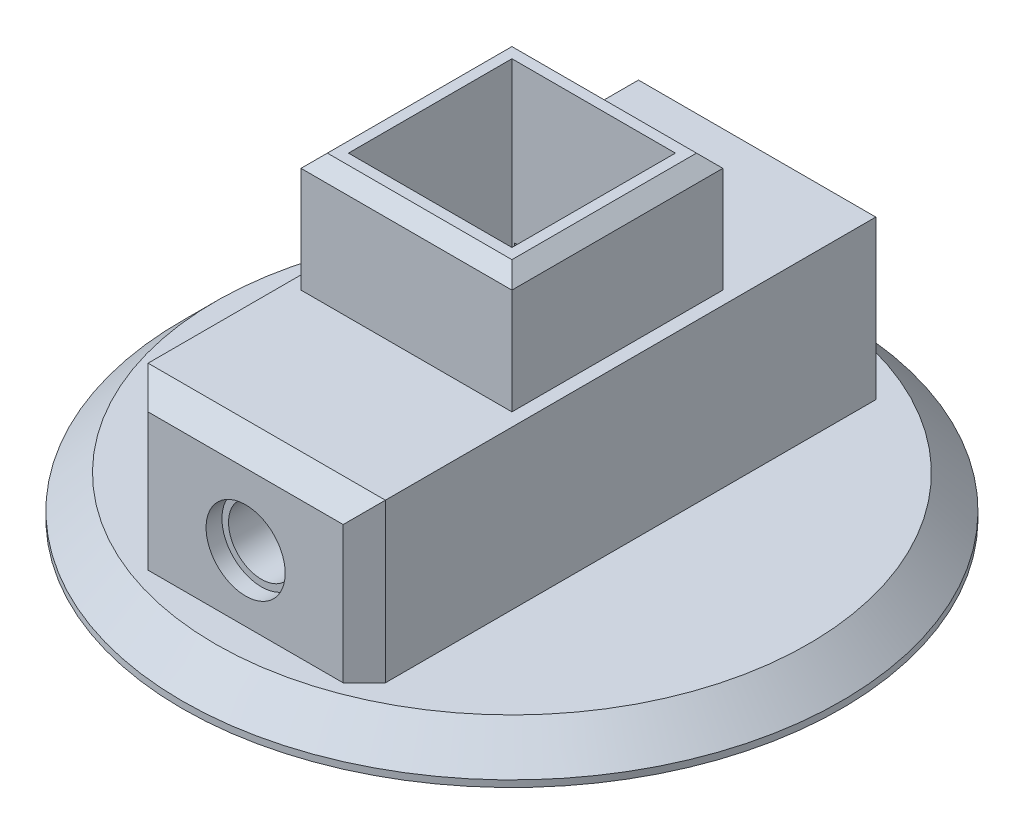
ISO-10303-21;
HEADER;
FILE_DESCRIPTION(('STEP AP214'),'2;1');
FILE_NAME('part.step','',(''),(''),'','','');
FILE_SCHEMA(('AUTOMOTIVE_DESIGN { 1 0 10303 214 1 1 1 1 }'));
ENDSEC;
DATA;
#1=APPLICATION_CONTEXT('core data for automotive mechanical design processes');
#2=APPLICATION_PROTOCOL_DEFINITION('international standard','automotive_design',2000,#1);
#3=PRODUCT_CONTEXT('',#1,'mechanical');
#4=PRODUCT('Part','Part','',(#3));
#5=PRODUCT_RELATED_PRODUCT_CATEGORY('part','',(#4));
#6=PRODUCT_DEFINITION_FORMATION('','',#4);
#7=PRODUCT_DEFINITION_CONTEXT('part definition',#1,'design');
#8=PRODUCT_DEFINITION('design','',#6,#7);
#9=PRODUCT_DEFINITION_SHAPE('','',#8);
#10=(LENGTH_UNIT() NAMED_UNIT(*) SI_UNIT(.MILLI.,.METRE.));
#11=(NAMED_UNIT(*) PLANE_ANGLE_UNIT() SI_UNIT($,.RADIAN.));
#12=(NAMED_UNIT(*) SI_UNIT($,.STERADIAN.) SOLID_ANGLE_UNIT());
#13=UNCERTAINTY_MEASURE_WITH_UNIT(LENGTH_MEASURE(1.E-05),#10,'distance_accuracy_value','');
#14=(GEOMETRIC_REPRESENTATION_CONTEXT(3) GLOBAL_UNCERTAINTY_ASSIGNED_CONTEXT((#13)) GLOBAL_UNIT_ASSIGNED_CONTEXT((#10,
#11,#12)) REPRESENTATION_CONTEXT('',''));
#15=CARTESIAN_POINT('',(0.,0.,0.));
#16=DIRECTION('',(0.,0.,1.));
#17=DIRECTION('',(1.,0.,0.));
#18=AXIS2_PLACEMENT_3D('',#15,#16,#17);
#19=CARTESIAN_POINT('',(0.,8.,3.2));
#20=DIRECTION('',(0.,0.,1.));
#21=DIRECTION('',(1.,0.,0.));
#22=AXIS2_PLACEMENT_3D('',#19,#20,#21);
#23=CYLINDRICAL_SURFACE('',#22,2.5);
#24=CARTESIAN_POINT('',(0.,8.,3.2));
#25=DIRECTION('',(0.,0.,1.));
#26=DIRECTION('',(1.,0.,0.));
#27=AXIS2_PLACEMENT_3D('',#24,#25,#26);
#28=CIRCLE('',#27,2.5);
#29=CARTESIAN_POINT('',(2.5,8.,3.2));
#30=VERTEX_POINT('',#29);
#31=EDGE_CURVE('E375',#30,#30,#28,.T.);
#32=ORIENTED_EDGE('',*,*,#31,.F.);
#33=EDGE_LOOP('',(#32));
#34=FACE_BOUND('',#33,.T.);
#35=CARTESIAN_POINT('',(0.,8.,11.));
#36=DIRECTION('',(0.,0.,1.));
#37=DIRECTION('',(1.,0.,0.));
#38=AXIS2_PLACEMENT_3D('',#35,#36,#37);
#39=CIRCLE('',#38,2.5);
#40=CARTESIAN_POINT('',(2.5,8.,11.));
#41=VERTEX_POINT('',#40);
#42=EDGE_CURVE('E39',#41,#41,#39,.F.);
#43=ORIENTED_EDGE('',*,*,#42,.F.);
#44=EDGE_LOOP('',(#43));
#45=FACE_BOUND('',#44,.T.);
#46=ADVANCED_FACE('F35',(#34,#45),#23,.F.);
#47=CARTESIAN_POINT('',(0.,8.,17.));
#48=DIRECTION('',(0.,0.,-1.));
#49=DIRECTION('',(-1.,0.,0.));
#50=AXIS2_PLACEMENT_3D('',#47,#48,#49);
#51=CYLINDRICAL_SURFACE('',#50,1.3);
#52=CARTESIAN_POINT('',(0.,8.,-1.8));
#53=DIRECTION('',(0.,0.,-1.));
#54=DIRECTION('',(-1.,0.,0.));
#55=AXIS2_PLACEMENT_3D('',#52,#53,#54);
#56=CIRCLE('',#55,1.3);
#57=CARTESIAN_POINT('',(-1.3,8.,-1.8));
#58=VERTEX_POINT('',#57);
#59=EDGE_CURVE('E209',#58,#58,#56,.T.);
#60=ORIENTED_EDGE('',*,*,#59,.T.);
#61=EDGE_LOOP('',(#60));
#62=FACE_BOUND('',#61,.T.);
#63=CARTESIAN_POINT('',(0.,8.,3.2));
#64=DIRECTION('',(0.,0.,1.));
#65=DIRECTION('',(1.,0.,0.));
#66=AXIS2_PLACEMENT_3D('',#63,#64,#65);
#67=CIRCLE('',#66,1.3);
#68=CARTESIAN_POINT('',(1.3,8.,3.2));
#69=VERTEX_POINT('',#68);
#70=EDGE_CURVE('E373',#69,#69,#67,.F.);
#71=ORIENTED_EDGE('',*,*,#70,.F.);
#72=EDGE_LOOP('',(#71));
#73=FACE_BOUND('',#72,.T.);
#74=ADVANCED_FACE('F464',(#62,#73),#51,.F.);
#75=CARTESIAN_POINT('',(0.,3.,-8.));
#76=DIRECTION('',(0.,1.,0.));
#77=DIRECTION('',(0.,0.,1.));
#78=AXIS2_PLACEMENT_3D('',#75,#76,#77);
#79=PLANE('',#78);
#80=CARTESIAN_POINT('',(0.,3.,-8.));
#81=DIRECTION('',(0.,1.,0.));
#82=DIRECTION('',(0.,0.,1.));
#83=AXIS2_PLACEMENT_3D('',#80,#81,#82);
#84=CIRCLE('',#83,22.5);
#85=CARTESIAN_POINT('',(0.,3.,14.5));
#86=VERTEX_POINT('',#85);
#87=EDGE_CURVE('E299',#86,#86,#84,.T.);
#88=ORIENTED_EDGE('',*,*,#87,.T.);
#89=EDGE_LOOP('',(#88));
#90=FACE_BOUND('',#89,.T.);
#91=DIRECTION('',(0.,0.,-1.));
#92=VECTOR('',#91,1.);
#93=CARTESIAN_POINT('',(9.,3.,-28.2));
#94=LINE('',#93,#92);
#95=CARTESIAN_POINT('',(9.,3.,10.6));
#96=VERTEX_POINT('',#95);
#97=CARTESIAN_POINT('',(9.,3.,-26.6));
#98=VERTEX_POINT('',#97);
#99=EDGE_CURVE('E249',#96,#98,#94,.T.);
#100=ORIENTED_EDGE('',*,*,#99,.F.);
#101=DIRECTION('',(0.707106781186548,0.,-0.707106781186548));
#102=VECTOR('',#101,1.);
#103=CARTESIAN_POINT('',(9.,3.,10.6));
#104=LINE('',#103,#102);
#105=CARTESIAN_POINT('',(7.39999999999999,3.,12.2));
#106=VERTEX_POINT('',#105);
#107=EDGE_CURVE('E333',#96,#106,#104,.F.);
#108=ORIENTED_EDGE('',*,*,#107,.T.);
#109=DIRECTION('',(1.,0.,0.));
#110=VECTOR('',#109,1.);
#111=CARTESIAN_POINT('',(-9.,3.,12.2));
#112=LINE('',#111,#110);
#113=CARTESIAN_POINT('',(-7.39999999999999,3.,12.2));
#114=VERTEX_POINT('',#113);
#115=EDGE_CURVE('E238',#114,#106,#112,.T.);
#116=ORIENTED_EDGE('',*,*,#115,.F.);
#117=DIRECTION('',(0.707106781186548,0.,0.707106781186548));
#118=VECTOR('',#117,1.);
#119=CARTESIAN_POINT('',(-7.39999999999999,3.,12.2));
#120=LINE('',#119,#118);
#121=CARTESIAN_POINT('',(-9.,3.,10.6));
#122=VERTEX_POINT('',#121);
#123=EDGE_CURVE('E331',#114,#122,#120,.F.);
#124=ORIENTED_EDGE('',*,*,#123,.T.);
#125=DIRECTION('',(0.,0.,1.));
#126=VECTOR('',#125,1.);
#127=CARTESIAN_POINT('',(-9.,3.,-28.2));
#128=LINE('',#127,#126);
#129=CARTESIAN_POINT('',(-9.,3.,-26.6));
#130=VERTEX_POINT('',#129);
#131=EDGE_CURVE('E243',#130,#122,#128,.T.);
#132=ORIENTED_EDGE('',*,*,#131,.F.);
#133=DIRECTION('',(-0.707106781186548,0.,0.707106781186548));
#134=VECTOR('',#133,1.);
#135=CARTESIAN_POINT('',(-9.,3.,-26.6));
#136=LINE('',#135,#134);
#137=CARTESIAN_POINT('',(-7.39999999999999,3.,-28.2));
#138=VERTEX_POINT('',#137);
#139=EDGE_CURVE('E335',#130,#138,#136,.F.);
#140=ORIENTED_EDGE('',*,*,#139,.T.);
#141=DIRECTION('',(-1.,0.,0.));
#142=VECTOR('',#141,1.);
#143=CARTESIAN_POINT('',(-9.,3.,-28.2));
#144=LINE('',#143,#142);
#145=CARTESIAN_POINT('',(7.39999999999999,3.,-28.2));
#146=VERTEX_POINT('',#145);
#147=EDGE_CURVE('E252',#146,#138,#144,.T.);
#148=ORIENTED_EDGE('',*,*,#147,.F.);
#149=DIRECTION('',(-0.707106781186548,0.,-0.707106781186548));
#150=VECTOR('',#149,1.);
#151=CARTESIAN_POINT('',(7.39999999999999,3.,-28.2));
#152=LINE('',#151,#150);
#153=EDGE_CURVE('E337',#146,#98,#152,.F.);
#154=ORIENTED_EDGE('',*,*,#153,.T.);
#155=EDGE_LOOP('',(#100,#108,#116,#124,#132,#140,#148,#154));
#156=FACE_BOUND('',#155,.T.);
#157=ADVANCED_FACE('F421',(#90,#156),#79,.T.);
#158=CARTESIAN_POINT('',(0.,3.,-8.));
#159=DIRECTION('',(0.,-1.,0.));
#160=DIRECTION('',(0.,0.,-1.));
#161=AXIS2_PLACEMENT_3D('',#158,#159,#160);
#162=CYLINDRICAL_SURFACE('',#161,25.);
#163=CARTESIAN_POINT('',(0.,0.499999999999984,-8.));
#164=DIRECTION('',(0.,1.,0.));
#165=DIRECTION('',(0.,0.,1.));
#166=AXIS2_PLACEMENT_3D('',#163,#164,#165);
#167=CIRCLE('',#166,25.);
#168=CARTESIAN_POINT('',(0.,0.499999999999984,17.));
#169=VERTEX_POINT('',#168);
#170=EDGE_CURVE('E302',#169,#169,#167,.F.);
#171=ORIENTED_EDGE('',*,*,#170,.T.);
#172=EDGE_LOOP('',(#171));
#173=FACE_BOUND('',#172,.T.);
#174=CARTESIAN_POINT('',(0.,0.,-8.));
#175=DIRECTION('',(0.,1.,0.));
#176=DIRECTION('',(0.,0.,1.));
#177=AXIS2_PLACEMENT_3D('',#174,#175,#176);
#178=CIRCLE('',#177,25.);
#179=CARTESIAN_POINT('',(0.,0.,17.));
#180=VERTEX_POINT('',#179);
#181=EDGE_CURVE('E246',#180,#180,#178,.T.);
#182=ORIENTED_EDGE('',*,*,#181,.T.);
#183=EDGE_LOOP('',(#182));
#184=FACE_BOUND('',#183,.T.);
#185=ADVANCED_FACE('F501',(#173,#184),#162,.T.);
#186=CARTESIAN_POINT('',(0.,0.,0.));
#187=DIRECTION('',(0.,-1.,0.));
#188=DIRECTION('',(0.,0.,-1.));
#189=AXIS2_PLACEMENT_3D('',#186,#187,#188);
#190=PLANE('',#189);
#191=ORIENTED_EDGE('',*,*,#181,.F.);
#192=EDGE_LOOP('',(#191));
#193=FACE_BOUND('',#192,.T.);
#194=ADVANCED_FACE('F505',(#193),#190,.T.);
#195=CARTESIAN_POINT('',(0.,3.,-8.));
#196=DIRECTION('',(0.,-1.,0.));
#197=DIRECTION('',(0.,0.,-1.));
#198=AXIS2_PLACEMENT_3D('',#195,#196,#197);
#199=CONICAL_SURFACE('',#198,22.5,0.785398163397447);
#200=ORIENTED_EDGE('',*,*,#170,.F.);
#201=EDGE_LOOP('',(#200));
#202=FACE_BOUND('',#201,.T.);
#203=ORIENTED_EDGE('',*,*,#87,.F.);
#204=EDGE_LOOP('',(#203));
#205=FACE_BOUND('',#204,.T.);
#206=ADVANCED_FACE('F490',(#202,#205),#199,.T.);
#207=CARTESIAN_POINT('',(0.,15.,0.));
#208=DIRECTION('',(0.,-1.,0.));
#209=DIRECTION('',(0.,0.,-1.));
#210=AXIS2_PLACEMENT_3D('',#207,#208,#209);
#211=PLANE('',#210);
#212=DIRECTION('',(0.,0.,1.));
#213=VECTOR('',#212,1.);
#214=CARTESIAN_POINT('',(-9.,15.,-28.2));
#215=LINE('',#214,#213);
#216=CARTESIAN_POINT('',(-9.,15.,-26.6));
#217=VERTEX_POINT('',#216);
#218=CARTESIAN_POINT('',(-9.,15.,10.6));
#219=VERTEX_POINT('',#218);
#220=EDGE_CURVE('E242',#217,#219,#215,.T.);
#221=ORIENTED_EDGE('',*,*,#220,.T.);
#222=DIRECTION('',(1.,0.,0.));
#223=VECTOR('',#222,1.);
#224=CARTESIAN_POINT('',(0.,15.,10.6));
#225=LINE('',#224,#223);
#226=CARTESIAN_POINT('',(9.,15.,10.6));
#227=VERTEX_POINT('',#226);
#228=EDGE_CURVE('E323',#219,#227,#225,.T.);
#229=ORIENTED_EDGE('',*,*,#228,.T.);
#230=DIRECTION('',(0.,0.,-1.));
#231=VECTOR('',#230,1.);
#232=CARTESIAN_POINT('',(9.,15.,-28.2));
#233=LINE('',#232,#231);
#234=CARTESIAN_POINT('',(9.,15.,-26.6));
#235=VERTEX_POINT('',#234);
#236=EDGE_CURVE('E239',#227,#235,#233,.T.);
#237=ORIENTED_EDGE('',*,*,#236,.T.);
#238=DIRECTION('',(-1.,0.,0.));
#239=VECTOR('',#238,1.);
#240=CARTESIAN_POINT('',(0.,15.,-26.6));
#241=LINE('',#240,#239);
#242=EDGE_CURVE('E321',#235,#217,#241,.T.);
#243=ORIENTED_EDGE('',*,*,#242,.T.);
#244=EDGE_LOOP('',(#221,#229,#237,#243));
#245=FACE_BOUND('',#244,.T.);
#246=DIRECTION('',(0.,0.,1.));
#247=VECTOR('',#246,1.);
#248=CARTESIAN_POINT('',(-8.,15.,-16.));
#249=LINE('',#248,#247);
#250=CARTESIAN_POINT('',(-8.,15.,-16.));
#251=VERTEX_POINT('',#250);
#252=CARTESIAN_POINT('',(-8.,15.,0.));
#253=VERTEX_POINT('',#252);
#254=EDGE_CURVE('E225',#251,#253,#249,.T.);
#255=ORIENTED_EDGE('',*,*,#254,.F.);
#256=DIRECTION('',(-1.,0.,0.));
#257=VECTOR('',#256,1.);
#258=CARTESIAN_POINT('',(-8.,15.,-16.));
#259=LINE('',#258,#257);
#260=CARTESIAN_POINT('',(8.,15.,-16.));
#261=VERTEX_POINT('',#260);
#262=EDGE_CURVE('E235',#261,#251,#259,.T.);
#263=ORIENTED_EDGE('',*,*,#262,.F.);
#264=DIRECTION('',(0.,0.,-1.));
#265=VECTOR('',#264,1.);
#266=CARTESIAN_POINT('',(8.,15.,-16.));
#267=LINE('',#266,#265);
#268=CARTESIAN_POINT('',(8.,15.,0.));
#269=VERTEX_POINT('',#268);
#270=EDGE_CURVE('E232',#269,#261,#267,.T.);
#271=ORIENTED_EDGE('',*,*,#270,.F.);
#272=DIRECTION('',(1.,0.,0.));
#273=VECTOR('',#272,1.);
#274=CARTESIAN_POINT('',(-8.,15.,0.));
#275=LINE('',#274,#273);
#276=EDGE_CURVE('E228',#253,#269,#275,.T.);
#277=ORIENTED_EDGE('',*,*,#276,.F.);
#278=EDGE_LOOP('',(#255,#263,#271,#277));
#279=FACE_BOUND('',#278,.T.);
#280=ADVANCED_FACE('F404',(#245,#279),#211,.F.);
#281=CARTESIAN_POINT('',(-9.,15.,12.2));
#282=DIRECTION('',(0.,0.,-1.));
#283=DIRECTION('',(-1.,0.,0.));
#284=AXIS2_PLACEMENT_3D('',#281,#282,#283);
#285=PLANE('',#284);
#286=CARTESIAN_POINT('',(0.,8.,12.2));
#287=DIRECTION('',(0.,0.,1.));
#288=DIRECTION('',(1.,0.,0.));
#289=AXIS2_PLACEMENT_3D('',#286,#287,#288);
#290=CIRCLE('',#289,3.);
#291=CARTESIAN_POINT('',(3.,8.,12.2));
#292=VERTEX_POINT('',#291);
#293=EDGE_CURVE('E385',#292,#292,#290,.T.);
#294=ORIENTED_EDGE('',*,*,#293,.F.);
#295=EDGE_LOOP('',(#294));
#296=FACE_BOUND('',#295,.T.);
#297=DIRECTION('',(-1.,0.,0.));
#298=VECTOR('',#297,1.);
#299=CARTESIAN_POINT('',(-9.,13.4,12.2));
#300=LINE('',#299,#298);
#301=CARTESIAN_POINT('',(7.39999999999999,13.4,12.2));
#302=VERTEX_POINT('',#301);
#303=CARTESIAN_POINT('',(-7.39999999999999,13.4,12.2));
#304=VERTEX_POINT('',#303);
#305=EDGE_CURVE('E305',#302,#304,#300,.T.);
#306=ORIENTED_EDGE('',*,*,#305,.T.);
#307=DIRECTION('',(0.,-1.,0.));
#308=VECTOR('',#307,1.);
#309=CARTESIAN_POINT('',(-7.39999999999999,15.,12.2));
#310=LINE('',#309,#308);
#311=EDGE_CURVE('E309',#304,#114,#310,.T.);
#312=ORIENTED_EDGE('',*,*,#311,.T.);
#313=ORIENTED_EDGE('',*,*,#115,.T.);
#314=DIRECTION('',(0.,1.,0.));
#315=VECTOR('',#314,1.);
#316=CARTESIAN_POINT('',(7.39999999999999,15.,12.2));
#317=LINE('',#316,#315);
#318=EDGE_CURVE('E307',#106,#302,#317,.T.);
#319=ORIENTED_EDGE('',*,*,#318,.T.);
#320=EDGE_LOOP('',(#306,#312,#313,#319));
#321=FACE_BOUND('',#320,.T.);
#322=ADVANCED_FACE('F400',(#296,#321),#285,.F.);
#323=CARTESIAN_POINT('',(9.,15.,-28.2));
#324=DIRECTION('',(-1.,0.,0.));
#325=DIRECTION('',(0.,0.,1.));
#326=AXIS2_PLACEMENT_3D('',#323,#324,#325);
#327=PLANE('',#326);
#328=ORIENTED_EDGE('',*,*,#236,.F.);
#329=DIRECTION('',(0.,-1.,0.));
#330=VECTOR('',#329,1.);
#331=CARTESIAN_POINT('',(9.,15.,10.6));
#332=LINE('',#331,#330);
#333=EDGE_CURVE('E319',#227,#96,#332,.T.);
#334=ORIENTED_EDGE('',*,*,#333,.T.);
#335=ORIENTED_EDGE('',*,*,#99,.T.);
#336=DIRECTION('',(0.,1.,0.));
#337=VECTOR('',#336,1.);
#338=CARTESIAN_POINT('',(9.,15.,-26.6));
#339=LINE('',#338,#337);
#340=EDGE_CURVE('E317',#98,#235,#339,.T.);
#341=ORIENTED_EDGE('',*,*,#340,.T.);
#342=EDGE_LOOP('',(#328,#334,#335,#341));
#343=FACE_BOUND('',#342,.T.);
#344=ADVANCED_FACE('F403',(#343),#327,.F.);
#345=CARTESIAN_POINT('',(-9.,15.,-28.2));
#346=DIRECTION('',(0.,0.,1.));
#347=DIRECTION('',(1.,0.,0.));
#348=AXIS2_PLACEMENT_3D('',#345,#346,#347);
#349=PLANE('',#348);
#350=DIRECTION('',(-1.,0.,0.));
#351=VECTOR('',#350,1.);
#352=CARTESIAN_POINT('',(6.,4.,-28.2));
#353=LINE('',#352,#351);
#354=CARTESIAN_POINT('',(6.,4.,-28.2));
#355=VERTEX_POINT('',#354);
#356=CARTESIAN_POINT('',(-6.,4.,-28.2));
#357=VERTEX_POINT('',#356);
#358=EDGE_CURVE('E215',#355,#357,#353,.T.);
#359=ORIENTED_EDGE('',*,*,#358,.F.);
#360=DIRECTION('',(0.,-1.,0.));
#361=VECTOR('',#360,1.);
#362=CARTESIAN_POINT('',(6.,12.,-28.2));
#363=LINE('',#362,#361);
#364=CARTESIAN_POINT('',(6.,12.,-28.2));
#365=VERTEX_POINT('',#364);
#366=EDGE_CURVE('E52',#365,#355,#363,.T.);
#367=ORIENTED_EDGE('',*,*,#366,.F.);
#368=DIRECTION('',(1.,0.,0.));
#369=VECTOR('',#368,1.);
#370=CARTESIAN_POINT('',(6.,12.,-28.2));
#371=LINE('',#370,#369);
#372=CARTESIAN_POINT('',(-6.,12.,-28.2));
#373=VERTEX_POINT('',#372);
#374=EDGE_CURVE('E203',#373,#365,#371,.T.);
#375=ORIENTED_EDGE('',*,*,#374,.F.);
#376=DIRECTION('',(0.,1.,0.));
#377=VECTOR('',#376,1.);
#378=CARTESIAN_POINT('',(-6.,12.,-28.2));
#379=LINE('',#378,#377);
#380=EDGE_CURVE('E206',#357,#373,#379,.T.);
#381=ORIENTED_EDGE('',*,*,#380,.F.);
#382=EDGE_LOOP('',(#359,#367,#375,#381));
#383=FACE_BOUND('',#382,.T.);
#384=ORIENTED_EDGE('',*,*,#147,.T.);
#385=DIRECTION('',(0.,1.,0.));
#386=VECTOR('',#385,1.);
#387=CARTESIAN_POINT('',(-7.39999999999999,15.,-28.2));
#388=LINE('',#387,#386);
#389=CARTESIAN_POINT('',(-7.39999999999999,13.4,-28.2));
#390=VERTEX_POINT('',#389);
#391=EDGE_CURVE('E329',#138,#390,#388,.T.);
#392=ORIENTED_EDGE('',*,*,#391,.T.);
#393=DIRECTION('',(1.,0.,0.));
#394=VECTOR('',#393,1.);
#395=CARTESIAN_POINT('',(-9.,13.4,-28.2));
#396=LINE('',#395,#394);
#397=CARTESIAN_POINT('',(7.39999999999999,13.4,-28.2));
#398=VERTEX_POINT('',#397);
#399=EDGE_CURVE('E327',#390,#398,#396,.T.);
#400=ORIENTED_EDGE('',*,*,#399,.T.);
#401=DIRECTION('',(0.,-1.,0.));
#402=VECTOR('',#401,1.);
#403=CARTESIAN_POINT('',(7.39999999999999,15.,-28.2));
#404=LINE('',#403,#402);
#405=EDGE_CURVE('E325',#398,#146,#404,.T.);
#406=ORIENTED_EDGE('',*,*,#405,.T.);
#407=EDGE_LOOP('',(#384,#392,#400,#406));
#408=FACE_BOUND('',#407,.T.);
#409=ADVANCED_FACE('F433',(#383,#408),#349,.F.);
#410=CARTESIAN_POINT('',(-9.,15.,-28.2));
#411=DIRECTION('',(1.,0.,0.));
#412=DIRECTION('',(0.,0.,-1.));
#413=AXIS2_PLACEMENT_3D('',#410,#411,#412);
#414=PLANE('',#413);
#415=ORIENTED_EDGE('',*,*,#131,.T.);
#416=DIRECTION('',(0.,1.,0.));
#417=VECTOR('',#416,1.);
#418=CARTESIAN_POINT('',(-9.,15.,10.6));
#419=LINE('',#418,#417);
#420=EDGE_CURVE('E315',#122,#219,#419,.T.);
#421=ORIENTED_EDGE('',*,*,#420,.T.);
#422=ORIENTED_EDGE('',*,*,#220,.F.);
#423=DIRECTION('',(0.,-1.,0.));
#424=VECTOR('',#423,1.);
#425=CARTESIAN_POINT('',(-9.,15.,-26.6));
#426=LINE('',#425,#424);
#427=EDGE_CURVE('E312',#217,#130,#426,.T.);
#428=ORIENTED_EDGE('',*,*,#427,.T.);
#429=EDGE_LOOP('',(#415,#421,#422,#428));
#430=FACE_BOUND('',#429,.T.);
#431=ADVANCED_FACE('F423',(#430),#414,.F.);
#432=DIRECTION('',(-1.,0.,0.));
#433=VECTOR('',#432,1.);
#434=CARTESIAN_POINT('',(-6.2,3.,-1.8));
#435=LINE('',#434,#433);
#436=CARTESIAN_POINT('',(6.2,3.,-1.8));
#437=VERTEX_POINT('',#436);
#438=CARTESIAN_POINT('',(-6.2,3.,-1.8));
#439=VERTEX_POINT('',#438);
#440=EDGE_CURVE('E265',#437,#439,#435,.T.);
#441=ORIENTED_EDGE('',*,*,#440,.F.);
#442=DIRECTION('',(0.,0.,1.));
#443=VECTOR('',#442,1.);
#444=CARTESIAN_POINT('',(6.2,3.,-14.2));
#445=LINE('',#444,#443);
#446=CARTESIAN_POINT('',(6.2,3.,-14.2));
#447=VERTEX_POINT('',#446);
#448=EDGE_CURVE('E262',#447,#437,#445,.T.);
#449=ORIENTED_EDGE('',*,*,#448,.F.);
#450=DIRECTION('',(1.,0.,0.));
#451=VECTOR('',#450,1.);
#452=CARTESIAN_POINT('',(-6.2,3.,-14.2));
#453=LINE('',#452,#451);
#454=CARTESIAN_POINT('',(-6.2,3.,-14.2));
#455=VERTEX_POINT('',#454);
#456=EDGE_CURVE('E259',#455,#447,#453,.T.);
#457=ORIENTED_EDGE('',*,*,#456,.F.);
#458=DIRECTION('',(0.,0.,-1.));
#459=VECTOR('',#458,1.);
#460=CARTESIAN_POINT('',(-6.2,3.,-14.2));
#461=LINE('',#460,#459);
#462=EDGE_CURVE('E296',#439,#455,#461,.T.);
#463=ORIENTED_EDGE('',*,*,#462,.F.);
#464=EDGE_LOOP('',(#441,#449,#457,#463));
#465=FACE_BOUND('',#464,.T.);
#466=ADVANCED_FACE('F493',(#465),#79,.T.);
#467=CARTESIAN_POINT('',(-6.2,-17.5362481734264,-14.2));
#468=DIRECTION('',(0.,0.,-1.));
#469=DIRECTION('',(-1.,0.,0.));
#470=AXIS2_PLACEMENT_3D('',#467,#468,#469);
#471=PLANE('',#470);
#472=DIRECTION('',(1.,0.,0.));
#473=VECTOR('',#472,1.);
#474=CARTESIAN_POINT('',(6.,12.,-14.2));
#475=LINE('',#474,#473);
#476=CARTESIAN_POINT('',(-6.,12.,-14.2));
#477=VERTEX_POINT('',#476);
#478=CARTESIAN_POINT('',(6.,12.,-14.2));
#479=VERTEX_POINT('',#478);
#480=EDGE_CURVE('E193',#477,#479,#475,.T.);
#481=ORIENTED_EDGE('',*,*,#480,.T.);
#482=DIRECTION('',(0.,-1.,0.));
#483=VECTOR('',#482,1.);
#484=CARTESIAN_POINT('',(6.,12.,-14.2));
#485=LINE('',#484,#483);
#486=CARTESIAN_POINT('',(6.,4.,-14.2));
#487=VERTEX_POINT('',#486);
#488=EDGE_CURVE('E187',#479,#487,#485,.T.);
#489=ORIENTED_EDGE('',*,*,#488,.T.);
#490=DIRECTION('',(-1.,0.,0.));
#491=VECTOR('',#490,1.);
#492=CARTESIAN_POINT('',(6.,4.,-14.2));
#493=LINE('',#492,#491);
#494=CARTESIAN_POINT('',(-6.,4.,-14.2));
#495=VERTEX_POINT('',#494);
#496=EDGE_CURVE('E196',#487,#495,#493,.T.);
#497=ORIENTED_EDGE('',*,*,#496,.T.);
#498=DIRECTION('',(0.,1.,0.));
#499=VECTOR('',#498,1.);
#500=CARTESIAN_POINT('',(-6.,12.,-14.2));
#501=LINE('',#500,#499);
#502=EDGE_CURVE('E60',#495,#477,#501,.T.);
#503=ORIENTED_EDGE('',*,*,#502,.T.);
#504=EDGE_LOOP('',(#481,#489,#497,#503));
#505=FACE_BOUND('',#504,.T.);
#506=DIRECTION('',(0.,1.,0.));
#507=VECTOR('',#506,1.);
#508=CARTESIAN_POINT('',(-6.2,-17.5362481734264,-14.2));
#509=LINE('',#508,#507);
#510=CARTESIAN_POINT('',(-6.2,24.,-14.2));
#511=VERTEX_POINT('',#510);
#512=EDGE_CURVE('E281',#455,#511,#509,.T.);
#513=ORIENTED_EDGE('',*,*,#512,.F.);
#514=ORIENTED_EDGE('',*,*,#456,.T.);
#515=DIRECTION('',(0.,1.,0.));
#516=VECTOR('',#515,1.);
#517=CARTESIAN_POINT('',(6.2,-17.5362481734264,-14.2));
#518=LINE('',#517,#516);
#519=CARTESIAN_POINT('',(6.2,24.,-14.2));
#520=VERTEX_POINT('',#519);
#521=EDGE_CURVE('E284',#447,#520,#518,.T.);
#522=ORIENTED_EDGE('',*,*,#521,.T.);
#523=DIRECTION('',(-1.,0.,0.));
#524=VECTOR('',#523,1.);
#525=CARTESIAN_POINT('',(-6.2,24.,-14.2));
#526=LINE('',#525,#524);
#527=EDGE_CURVE('E269',#520,#511,#526,.T.);
#528=ORIENTED_EDGE('',*,*,#527,.T.);
#529=EDGE_LOOP('',(#513,#514,#522,#528));
#530=FACE_BOUND('',#529,.T.);
#531=ADVANCED_FACE('F200',(#505,#530),#471,.F.);
#532=CARTESIAN_POINT('',(-6.2,-17.5362481734264,-14.2));
#533=DIRECTION('',(-1.,0.,0.));
#534=DIRECTION('',(0.,0.,1.));
#535=AXIS2_PLACEMENT_3D('',#532,#533,#534);
#536=PLANE('',#535);
#537=DIRECTION('',(0.,1.,0.));
#538=VECTOR('',#537,1.);
#539=CARTESIAN_POINT('',(-6.2,-17.5362481734264,-1.8));
#540=LINE('',#539,#538);
#541=CARTESIAN_POINT('',(-6.2,24.,-1.8));
#542=VERTEX_POINT('',#541);
#543=EDGE_CURVE('E283',#439,#542,#540,.T.);
#544=ORIENTED_EDGE('',*,*,#543,.F.);
#545=ORIENTED_EDGE('',*,*,#462,.T.);
#546=ORIENTED_EDGE('',*,*,#512,.T.);
#547=DIRECTION('',(0.,0.,1.));
#548=VECTOR('',#547,1.);
#549=CARTESIAN_POINT('',(-6.2,24.,-14.2));
#550=LINE('',#549,#548);
#551=EDGE_CURVE('E268',#511,#542,#550,.T.);
#552=ORIENTED_EDGE('',*,*,#551,.T.);
#553=EDGE_LOOP('',(#544,#545,#546,#552));
#554=FACE_BOUND('',#553,.T.);
#555=ADVANCED_FACE('F507',(#554),#536,.F.);
#556=CARTESIAN_POINT('',(-6.2,-17.5362481734264,-1.8));
#557=DIRECTION('',(0.,0.,1.));
#558=DIRECTION('',(1.,0.,0.));
#559=AXIS2_PLACEMENT_3D('',#556,#557,#558);
#560=PLANE('',#559);
#561=ORIENTED_EDGE('',*,*,#59,.F.);
#562=EDGE_LOOP('',(#561));
#563=FACE_BOUND('',#562,.T.);
#564=DIRECTION('',(0.,1.,0.));
#565=VECTOR('',#564,1.);
#566=CARTESIAN_POINT('',(6.2,-17.5362481734264,-1.8));
#567=LINE('',#566,#565);
#568=CARTESIAN_POINT('',(6.2,24.,-1.8));
#569=VERTEX_POINT('',#568);
#570=EDGE_CURVE('E272',#437,#569,#567,.T.);
#571=ORIENTED_EDGE('',*,*,#570,.F.);
#572=ORIENTED_EDGE('',*,*,#440,.T.);
#573=ORIENTED_EDGE('',*,*,#543,.T.);
#574=DIRECTION('',(1.,0.,0.));
#575=VECTOR('',#574,1.);
#576=CARTESIAN_POINT('',(-6.2,24.,-1.8));
#577=LINE('',#576,#575);
#578=EDGE_CURVE('E276',#542,#569,#577,.T.);
#579=ORIENTED_EDGE('',*,*,#578,.T.);
#580=EDGE_LOOP('',(#571,#572,#573,#579));
#581=FACE_BOUND('',#580,.T.);
#582=ADVANCED_FACE('F510',(#563,#581),#560,.F.);
#583=CARTESIAN_POINT('',(6.2,-17.5362481734264,-14.2));
#584=DIRECTION('',(1.,0.,0.));
#585=DIRECTION('',(0.,0.,-1.));
#586=AXIS2_PLACEMENT_3D('',#583,#584,#585);
#587=PLANE('',#586);
#588=ORIENTED_EDGE('',*,*,#521,.F.);
#589=ORIENTED_EDGE('',*,*,#448,.T.);
#590=ORIENTED_EDGE('',*,*,#570,.T.);
#591=DIRECTION('',(0.,0.,-1.));
#592=VECTOR('',#591,1.);
#593=CARTESIAN_POINT('',(6.2,24.,-14.2));
#594=LINE('',#593,#592);
#595=EDGE_CURVE('E273',#569,#520,#594,.T.);
#596=ORIENTED_EDGE('',*,*,#595,.T.);
#597=EDGE_LOOP('',(#588,#589,#590,#596));
#598=FACE_BOUND('',#597,.T.);
#599=ADVANCED_FACE('F514',(#598),#587,.F.);
#600=CARTESIAN_POINT('',(0.,24.,0.));
#601=DIRECTION('',(0.,-1.,0.));
#602=DIRECTION('',(0.,0.,-1.));
#603=AXIS2_PLACEMENT_3D('',#600,#601,#602);
#604=PLANE('',#603);
#605=DIRECTION('',(0.,0.,1.));
#606=VECTOR('',#605,1.);
#607=CARTESIAN_POINT('',(-7.,24.,0.));
#608=LINE('',#607,#606);
#609=CARTESIAN_POINT('',(-7.00000000000001,24.,-15.));
#610=VERTEX_POINT('',#609);
#611=CARTESIAN_POINT('',(-7.,24.,-0.999999999999994));
#612=VERTEX_POINT('',#611);
#613=EDGE_CURVE('E355',#610,#612,#608,.T.);
#614=ORIENTED_EDGE('',*,*,#613,.T.);
#615=DIRECTION('',(1.,0.,0.));
#616=VECTOR('',#615,1.);
#617=CARTESIAN_POINT('',(0.,24.,-0.999999999999995));
#618=LINE('',#617,#616);
#619=CARTESIAN_POINT('',(7.00000000000001,24.,-0.999999999999996));
#620=VERTEX_POINT('',#619);
#621=EDGE_CURVE('E357',#612,#620,#618,.T.);
#622=ORIENTED_EDGE('',*,*,#621,.T.);
#623=DIRECTION('',(0.,0.,-1.));
#624=VECTOR('',#623,1.);
#625=CARTESIAN_POINT('',(7.00000000000001,24.,0.));
#626=LINE('',#625,#624);
#627=CARTESIAN_POINT('',(7.00000000000001,24.,-15.));
#628=VERTEX_POINT('',#627);
#629=EDGE_CURVE('E339',#620,#628,#626,.T.);
#630=ORIENTED_EDGE('',*,*,#629,.T.);
#631=DIRECTION('',(-1.,0.,0.));
#632=VECTOR('',#631,1.);
#633=CARTESIAN_POINT('',(0.,24.,-15.));
#634=LINE('',#633,#632);
#635=EDGE_CURVE('E353',#628,#610,#634,.T.);
#636=ORIENTED_EDGE('',*,*,#635,.T.);
#637=EDGE_LOOP('',(#614,#622,#630,#636));
#638=FACE_BOUND('',#637,.T.);
#639=ORIENTED_EDGE('',*,*,#595,.F.);
#640=ORIENTED_EDGE('',*,*,#578,.F.);
#641=ORIENTED_EDGE('',*,*,#551,.F.);
#642=ORIENTED_EDGE('',*,*,#527,.F.);
#643=EDGE_LOOP('',(#639,#640,#641,#642));
#644=FACE_BOUND('',#643,.T.);
#645=ADVANCED_FACE('F517',(#638,#644),#604,.F.);
#646=CARTESIAN_POINT('',(-8.,24.,0.));
#647=DIRECTION('',(0.,0.,-1.));
#648=DIRECTION('',(-1.,0.,0.));
#649=AXIS2_PLACEMENT_3D('',#646,#647,#648);
#650=PLANE('',#649);
#651=DIRECTION('',(0.,-1.,0.));
#652=VECTOR('',#651,1.);
#653=CARTESIAN_POINT('',(8.,24.,0.));
#654=LINE('',#653,#652);
#655=CARTESIAN_POINT('',(8.,23.,0.));
#656=VERTEX_POINT('',#655);
#657=EDGE_CURVE('E294',#656,#269,#654,.T.);
#658=ORIENTED_EDGE('',*,*,#657,.F.);
#659=DIRECTION('',(-1.,0.,0.));
#660=VECTOR('',#659,1.);
#661=CARTESIAN_POINT('',(-8.,23.,0.));
#662=LINE('',#661,#660);
#663=CARTESIAN_POINT('',(-8.,23.,0.));
#664=VERTEX_POINT('',#663);
#665=EDGE_CURVE('E360',#656,#664,#662,.T.);
#666=ORIENTED_EDGE('',*,*,#665,.T.);
#667=DIRECTION('',(0.,-1.,0.));
#668=VECTOR('',#667,1.);
#669=CARTESIAN_POINT('',(-8.,24.,0.));
#670=LINE('',#669,#668);
#671=EDGE_CURVE('E288',#664,#253,#670,.T.);
#672=ORIENTED_EDGE('',*,*,#671,.T.);
#673=ORIENTED_EDGE('',*,*,#276,.T.);
#674=EDGE_LOOP('',(#658,#666,#672,#673));
#675=FACE_BOUND('',#674,.T.);
#676=ADVANCED_FACE('F524',(#675),#650,.F.);
#677=CARTESIAN_POINT('',(8.,24.,-16.));
#678=DIRECTION('',(-1.,0.,0.));
#679=DIRECTION('',(0.,0.,1.));
#680=AXIS2_PLACEMENT_3D('',#677,#678,#679);
#681=PLANE('',#680);
#682=DIRECTION('',(0.,-1.,0.));
#683=VECTOR('',#682,1.);
#684=CARTESIAN_POINT('',(8.,24.,-16.));
#685=LINE('',#684,#683);
#686=CARTESIAN_POINT('',(8.,23.,-16.));
#687=VERTEX_POINT('',#686);
#688=EDGE_CURVE('E292',#687,#261,#685,.T.);
#689=ORIENTED_EDGE('',*,*,#688,.F.);
#690=DIRECTION('',(0.,0.,1.));
#691=VECTOR('',#690,1.);
#692=CARTESIAN_POINT('',(8.,23.,-16.));
#693=LINE('',#692,#691);
#694=EDGE_CURVE('E12',#687,#656,#693,.T.);
#695=ORIENTED_EDGE('',*,*,#694,.T.);
#696=ORIENTED_EDGE('',*,*,#657,.T.);
#697=ORIENTED_EDGE('',*,*,#270,.T.);
#698=EDGE_LOOP('',(#689,#695,#696,#697));
#699=FACE_BOUND('',#698,.T.);
#700=ADVANCED_FACE('F531',(#699),#681,.F.);
#701=CARTESIAN_POINT('',(-8.,24.,-16.));
#702=DIRECTION('',(0.,0.,1.));
#703=DIRECTION('',(1.,0.,0.));
#704=AXIS2_PLACEMENT_3D('',#701,#702,#703);
#705=PLANE('',#704);
#706=DIRECTION('',(0.,-1.,0.));
#707=VECTOR('',#706,1.);
#708=CARTESIAN_POINT('',(-8.,24.,-16.));
#709=LINE('',#708,#707);
#710=CARTESIAN_POINT('',(-8.,23.,-16.));
#711=VERTEX_POINT('',#710);
#712=EDGE_CURVE('E290',#711,#251,#709,.T.);
#713=ORIENTED_EDGE('',*,*,#712,.F.);
#714=DIRECTION('',(1.,0.,0.));
#715=VECTOR('',#714,1.);
#716=CARTESIAN_POINT('',(-8.,23.,-16.));
#717=LINE('',#716,#715);
#718=EDGE_CURVE('E44',#711,#687,#717,.T.);
#719=ORIENTED_EDGE('',*,*,#718,.T.);
#720=ORIENTED_EDGE('',*,*,#688,.T.);
#721=ORIENTED_EDGE('',*,*,#262,.T.);
#722=EDGE_LOOP('',(#713,#719,#720,#721));
#723=FACE_BOUND('',#722,.T.);
#724=ADVANCED_FACE('F459',(#723),#705,.F.);
#725=CARTESIAN_POINT('',(-8.,24.,-16.));
#726=DIRECTION('',(1.,0.,0.));
#727=DIRECTION('',(0.,0.,-1.));
#728=AXIS2_PLACEMENT_3D('',#725,#726,#727);
#729=PLANE('',#728);
#730=ORIENTED_EDGE('',*,*,#671,.F.);
#731=DIRECTION('',(0.,0.,-1.));
#732=VECTOR('',#731,1.);
#733=CARTESIAN_POINT('',(-8.,23.,-16.));
#734=LINE('',#733,#732);
#735=EDGE_CURVE('E363',#664,#711,#734,.T.);
#736=ORIENTED_EDGE('',*,*,#735,.T.);
#737=ORIENTED_EDGE('',*,*,#712,.T.);
#738=ORIENTED_EDGE('',*,*,#254,.T.);
#739=EDGE_LOOP('',(#730,#736,#737,#738));
#740=FACE_BOUND('',#739,.T.);
#741=ADVANCED_FACE('F452',(#740),#729,.F.);
#742=CARTESIAN_POINT('',(9.,15.,10.6));
#743=DIRECTION('',(-0.707106781186547,0.,-0.707106781186547));
#744=DIRECTION('',(0.,-1.,0.));
#745=AXIS2_PLACEMENT_3D('',#742,#743,#744);
#746=PLANE('',#745);
#747=ORIENTED_EDGE('',*,*,#107,.F.);
#748=ORIENTED_EDGE('',*,*,#333,.F.);
#749=DIRECTION('',(0.577350269189626,0.577350269189626,-0.577350269189626));
#750=VECTOR('',#749,1.);
#751=CARTESIAN_POINT('',(6.,12.,13.6));
#752=LINE('',#751,#750);
#753=EDGE_CURVE('E229',#302,#227,#752,.T.);
#754=ORIENTED_EDGE('',*,*,#753,.F.);
#755=ORIENTED_EDGE('',*,*,#318,.F.);
#756=EDGE_LOOP('',(#747,#748,#754,#755));
#757=FACE_BOUND('',#756,.T.);
#758=ADVANCED_FACE('F450',(#757),#746,.F.);
#759=CARTESIAN_POINT('',(0.,15.,10.6));
#760=DIRECTION('',(0.,-0.707106781186547,-0.707106781186547));
#761=DIRECTION('',(1.,0.,0.));
#762=AXIS2_PLACEMENT_3D('',#759,#760,#761);
#763=PLANE('',#762);
#764=ORIENTED_EDGE('',*,*,#753,.T.);
#765=ORIENTED_EDGE('',*,*,#228,.F.);
#766=DIRECTION('',(0.577350269189626,-0.577350269189626,0.577350269189626));
#767=VECTOR('',#766,1.);
#768=CARTESIAN_POINT('',(-6.,12.,13.6));
#769=LINE('',#768,#767);
#770=EDGE_CURVE('E340',#304,#219,#769,.F.);
#771=ORIENTED_EDGE('',*,*,#770,.F.);
#772=ORIENTED_EDGE('',*,*,#305,.F.);
#773=EDGE_LOOP('',(#764,#765,#771,#772));
#774=FACE_BOUND('',#773,.T.);
#775=ADVANCED_FACE('F414',(#774),#763,.F.);
#776=CARTESIAN_POINT('',(-7.39999999999999,15.,12.2));
#777=DIRECTION('',(0.707106781186547,0.,-0.707106781186547));
#778=DIRECTION('',(0.,-1.,0.));
#779=AXIS2_PLACEMENT_3D('',#776,#777,#778);
#780=PLANE('',#779);
#781=ORIENTED_EDGE('',*,*,#770,.T.);
#782=ORIENTED_EDGE('',*,*,#420,.F.);
#783=ORIENTED_EDGE('',*,*,#123,.F.);
#784=ORIENTED_EDGE('',*,*,#311,.F.);
#785=EDGE_LOOP('',(#781,#782,#783,#784));
#786=FACE_BOUND('',#785,.T.);
#787=ADVANCED_FACE('F417',(#786),#780,.F.);
#788=CARTESIAN_POINT('',(7.39999999999999,15.,-28.2));
#789=DIRECTION('',(-0.707106781186547,0.,0.707106781186547));
#790=DIRECTION('',(0.,-1.,0.));
#791=AXIS2_PLACEMENT_3D('',#788,#789,#790);
#792=PLANE('',#791);
#793=ORIENTED_EDGE('',*,*,#153,.F.);
#794=ORIENTED_EDGE('',*,*,#405,.F.);
#795=DIRECTION('',(0.577350269189626,0.577350269189626,0.577350269189626));
#796=VECTOR('',#795,1.);
#797=CARTESIAN_POINT('',(7.93333333333333,13.9333333333333,-27.6666666666667));
#798=LINE('',#797,#796);
#799=EDGE_CURVE('E343',#235,#398,#798,.F.);
#800=ORIENTED_EDGE('',*,*,#799,.F.);
#801=ORIENTED_EDGE('',*,*,#340,.F.);
#802=EDGE_LOOP('',(#793,#794,#800,#801));
#803=FACE_BOUND('',#802,.T.);
#804=ADVANCED_FACE('F438',(#803),#792,.F.);
#805=CARTESIAN_POINT('',(0.,15.,-26.6));
#806=DIRECTION('',(0.,-0.707106781186547,0.707106781186547));
#807=DIRECTION('',(-1.,0.,0.));
#808=AXIS2_PLACEMENT_3D('',#805,#806,#807);
#809=PLANE('',#808);
#810=ORIENTED_EDGE('',*,*,#799,.T.);
#811=ORIENTED_EDGE('',*,*,#399,.F.);
#812=DIRECTION('',(-0.577350269189626,0.577350269189626,0.577350269189626));
#813=VECTOR('',#812,1.);
#814=CARTESIAN_POINT('',(-6.,12.,-29.6));
#815=LINE('',#814,#813);
#816=EDGE_CURVE('E346',#217,#390,#815,.F.);
#817=ORIENTED_EDGE('',*,*,#816,.F.);
#818=ORIENTED_EDGE('',*,*,#242,.F.);
#819=EDGE_LOOP('',(#810,#811,#817,#818));
#820=FACE_BOUND('',#819,.T.);
#821=ADVANCED_FACE('F442',(#820),#809,.F.);
#822=CARTESIAN_POINT('',(-9.,15.,-26.6));
#823=DIRECTION('',(0.707106781186547,0.,0.707106781186547));
#824=DIRECTION('',(0.,-1.,0.));
#825=AXIS2_PLACEMENT_3D('',#822,#823,#824);
#826=PLANE('',#825);
#827=ORIENTED_EDGE('',*,*,#816,.T.);
#828=ORIENTED_EDGE('',*,*,#391,.F.);
#829=ORIENTED_EDGE('',*,*,#139,.F.);
#830=ORIENTED_EDGE('',*,*,#427,.F.);
#831=EDGE_LOOP('',(#827,#828,#829,#830));
#832=FACE_BOUND('',#831,.T.);
#833=ADVANCED_FACE('F428',(#832),#826,.F.);
#834=CARTESIAN_POINT('',(0.,24.,-15.));
#835=DIRECTION('',(0.,-0.707106781186545,0.70710678118655));
#836=DIRECTION('',(-1.,0.,0.));
#837=AXIS2_PLACEMENT_3D('',#834,#835,#836);
#838=PLANE('',#837);
#839=DIRECTION('',(-0.577350269189624,0.577350269189628,0.577350269189625));
#840=VECTOR('',#839,1.);
#841=CARTESIAN_POINT('',(2.00000000000003,29.,-10.));
#842=LINE('',#841,#840);
#843=EDGE_CURVE('E369',#687,#628,#842,.T.);
#844=ORIENTED_EDGE('',*,*,#843,.F.);
#845=ORIENTED_EDGE('',*,*,#718,.F.);
#846=DIRECTION('',(0.577350269189624,0.577350269189628,0.577350269189624));
#847=VECTOR('',#846,1.);
#848=CARTESIAN_POINT('',(-4.66666666666668,26.3333333333333,-12.6666666666667));
#849=LINE('',#848,#847);
#850=EDGE_CURVE('E349',#610,#711,#849,.F.);
#851=ORIENTED_EDGE('',*,*,#850,.F.);
#852=ORIENTED_EDGE('',*,*,#635,.F.);
#853=EDGE_LOOP('',(#844,#845,#851,#852));
#854=FACE_BOUND('',#853,.T.);
#855=ADVANCED_FACE('F37',(#854),#838,.F.);
#856=CARTESIAN_POINT('',(-7.,24.,0.));
#857=DIRECTION('',(0.70710678118655,-0.707106781186545,0.));
#858=DIRECTION('',(0.,0.,1.));
#859=AXIS2_PLACEMENT_3D('',#856,#857,#858);
#860=PLANE('',#859);
#861=ORIENTED_EDGE('',*,*,#850,.T.);
#862=ORIENTED_EDGE('',*,*,#735,.F.);
#863=DIRECTION('',(0.577350269189624,0.577350269189628,-0.577350269189625));
#864=VECTOR('',#863,1.);
#865=CARTESIAN_POINT('',(-7.33333333333333,23.6666666666667,-0.666666666666664));
#866=LINE('',#865,#864);
#867=EDGE_CURVE('E367',#612,#664,#866,.F.);
#868=ORIENTED_EDGE('',*,*,#867,.F.);
#869=ORIENTED_EDGE('',*,*,#613,.F.);
#870=EDGE_LOOP('',(#861,#862,#868,#869));
#871=FACE_BOUND('',#870,.T.);
#872=ADVANCED_FACE('F557',(#871),#860,.F.);
#873=CARTESIAN_POINT('',(7.00000000000001,24.,0.));
#874=DIRECTION('',(-0.70710678118655,-0.707106781186545,0.));
#875=DIRECTION('',(0.,0.,-1.));
#876=AXIS2_PLACEMENT_3D('',#873,#874,#875);
#877=PLANE('',#876);
#878=ORIENTED_EDGE('',*,*,#843,.T.);
#879=ORIENTED_EDGE('',*,*,#629,.F.);
#880=DIRECTION('',(0.577350269189624,-0.577350269189628,0.577350269189624));
#881=VECTOR('',#880,1.);
#882=CARTESIAN_POINT('',(7.33333333333334,23.6666666666667,-0.666666666666666));
#883=LINE('',#882,#881);
#884=EDGE_CURVE('E221',#656,#620,#883,.F.);
#885=ORIENTED_EDGE('',*,*,#884,.F.);
#886=ORIENTED_EDGE('',*,*,#694,.F.);
#887=EDGE_LOOP('',(#878,#879,#885,#886));
#888=FACE_BOUND('',#887,.T.);
#889=ADVANCED_FACE('F554',(#888),#877,.F.);
#890=CARTESIAN_POINT('',(0.,24.,-0.999999999999995));
#891=DIRECTION('',(0.,-0.707106781186545,-0.70710678118655));
#892=DIRECTION('',(1.,0.,0.));
#893=AXIS2_PLACEMENT_3D('',#890,#891,#892);
#894=PLANE('',#893);
#895=ORIENTED_EDGE('',*,*,#867,.T.);
#896=ORIENTED_EDGE('',*,*,#665,.F.);
#897=ORIENTED_EDGE('',*,*,#884,.T.);
#898=ORIENTED_EDGE('',*,*,#621,.F.);
#899=EDGE_LOOP('',(#895,#896,#897,#898));
#900=FACE_BOUND('',#899,.T.);
#901=ADVANCED_FACE('F487',(#900),#894,.F.);
#902=CARTESIAN_POINT('',(6.,12.,-14.2));
#903=DIRECTION('',(1.,0.,0.));
#904=DIRECTION('',(0.,1.,0.));
#905=AXIS2_PLACEMENT_3D('',#902,#903,#904);
#906=PLANE('',#905);
#907=ORIENTED_EDGE('',*,*,#366,.T.);
#908=DIRECTION('',(0.,0.,-1.));
#909=VECTOR('',#908,1.);
#910=CARTESIAN_POINT('',(6.,4.,-14.2));
#911=LINE('',#910,#909);
#912=EDGE_CURVE('E183',#487,#355,#911,.T.);
#913=ORIENTED_EDGE('',*,*,#912,.F.);
#914=ORIENTED_EDGE('',*,*,#488,.F.);
#915=DIRECTION('',(0.,0.,-1.));
#916=VECTOR('',#915,1.);
#917=CARTESIAN_POINT('',(6.,12.,-14.2));
#918=LINE('',#917,#916);
#919=EDGE_CURVE('E219',#479,#365,#918,.T.);
#920=ORIENTED_EDGE('',*,*,#919,.T.);
#921=EDGE_LOOP('',(#907,#913,#914,#920));
#922=FACE_BOUND('',#921,.T.);
#923=ADVANCED_FACE('F185',(#922),#906,.F.);
#924=CARTESIAN_POINT('',(6.,12.,-14.2));
#925=DIRECTION('',(0.,1.,0.));
#926=DIRECTION('',(-1.,0.,0.));
#927=AXIS2_PLACEMENT_3D('',#924,#925,#926);
#928=PLANE('',#927);
#929=ORIENTED_EDGE('',*,*,#374,.T.);
#930=ORIENTED_EDGE('',*,*,#919,.F.);
#931=ORIENTED_EDGE('',*,*,#480,.F.);
#932=DIRECTION('',(0.,0.,-1.));
#933=VECTOR('',#932,1.);
#934=CARTESIAN_POINT('',(-6.,12.,-14.2));
#935=LINE('',#934,#933);
#936=EDGE_CURVE('E222',#477,#373,#935,.T.);
#937=ORIENTED_EDGE('',*,*,#936,.T.);
#938=EDGE_LOOP('',(#929,#930,#931,#937));
#939=FACE_BOUND('',#938,.T.);
#940=ADVANCED_FACE('F476',(#939),#928,.F.);
#941=CARTESIAN_POINT('',(-6.,12.,-14.2));
#942=DIRECTION('',(-1.,0.,0.));
#943=DIRECTION('',(0.,-1.,0.));
#944=AXIS2_PLACEMENT_3D('',#941,#942,#943);
#945=PLANE('',#944);
#946=ORIENTED_EDGE('',*,*,#380,.T.);
#947=ORIENTED_EDGE('',*,*,#936,.F.);
#948=ORIENTED_EDGE('',*,*,#502,.F.);
#949=DIRECTION('',(0.,0.,-1.));
#950=VECTOR('',#949,1.);
#951=CARTESIAN_POINT('',(-6.,4.,-14.2));
#952=LINE('',#951,#950);
#953=EDGE_CURVE('E192',#495,#357,#952,.T.);
#954=ORIENTED_EDGE('',*,*,#953,.T.);
#955=EDGE_LOOP('',(#946,#947,#948,#954));
#956=FACE_BOUND('',#955,.T.);
#957=ADVANCED_FACE('F479',(#956),#945,.F.);
#958=CARTESIAN_POINT('',(6.,4.,-14.2));
#959=DIRECTION('',(0.,-1.,0.));
#960=DIRECTION('',(1.,0.,0.));
#961=AXIS2_PLACEMENT_3D('',#958,#959,#960);
#962=PLANE('',#961);
#963=ORIENTED_EDGE('',*,*,#358,.T.);
#964=ORIENTED_EDGE('',*,*,#953,.F.);
#965=ORIENTED_EDGE('',*,*,#496,.F.);
#966=ORIENTED_EDGE('',*,*,#912,.T.);
#967=EDGE_LOOP('',(#963,#964,#965,#966));
#968=FACE_BOUND('',#967,.T.);
#969=ADVANCED_FACE('F197',(#968),#962,.F.);
#970=CARTESIAN_POINT('',(0.,8.,3.2));
#971=DIRECTION('',(0.,0.,1.));
#972=DIRECTION('',(1.,0.,0.));
#973=AXIS2_PLACEMENT_3D('',#970,#971,#972);
#974=PLANE('',#973);
#975=ORIENTED_EDGE('',*,*,#31,.T.);
#976=EDGE_LOOP('',(#975));
#977=FACE_BOUND('',#976,.T.);
#978=ORIENTED_EDGE('',*,*,#70,.T.);
#979=EDGE_LOOP('',(#978));
#980=FACE_BOUND('',#979,.T.);
#981=ADVANCED_FACE('F474',(#977,#980),#974,.T.);
#982=CARTESIAN_POINT('',(0.,8.,11.));
#983=DIRECTION('',(0.,0.,1.));
#984=DIRECTION('',(1.,0.,0.));
#985=AXIS2_PLACEMENT_3D('',#982,#983,#984);
#986=PLANE('',#985);
#987=CARTESIAN_POINT('',(0.,8.,11.));
#988=DIRECTION('',(0.,0.,1.));
#989=DIRECTION('',(1.,0.,0.));
#990=AXIS2_PLACEMENT_3D('',#987,#988,#989);
#991=CIRCLE('',#990,3.);
#992=CARTESIAN_POINT('',(3.,8.,11.));
#993=VERTEX_POINT('',#992);
#994=EDGE_CURVE('E383',#993,#993,#991,.T.);
#995=ORIENTED_EDGE('',*,*,#994,.T.);
#996=EDGE_LOOP('',(#995));
#997=FACE_BOUND('',#996,.T.);
#998=ORIENTED_EDGE('',*,*,#42,.T.);
#999=EDGE_LOOP('',(#998));
#1000=FACE_BOUND('',#999,.T.);
#1001=ADVANCED_FACE('F391',(#997,#1000),#986,.T.);
#1002=CARTESIAN_POINT('',(0.,8.,11.));
#1003=DIRECTION('',(0.,0.,1.));
#1004=DIRECTION('',(1.,0.,0.));
#1005=AXIS2_PLACEMENT_3D('',#1002,#1003,#1004);
#1006=CYLINDRICAL_SURFACE('',#1005,3.);
#1007=ORIENTED_EDGE('',*,*,#994,.F.);
#1008=EDGE_LOOP('',(#1007));
#1009=FACE_BOUND('',#1008,.T.);
#1010=ORIENTED_EDGE('',*,*,#293,.T.);
#1011=EDGE_LOOP('',(#1010));
#1012=FACE_BOUND('',#1011,.T.);
#1013=ADVANCED_FACE('F394',(#1009,#1012),#1006,.F.);
#1014=CLOSED_SHELL('',(#46,#74,#157,#185,#194,#206,#280,#322,#344,#409,#431,#466,#531,#555,#582,
#599,#645,#676,#700,#724,#741,#758,#775,#787,#804,#821,#833,#855,#872,#889,#901,#923,#940,#957,
#969,#981,#1001,#1013));
#1015=MANIFOLD_SOLID_BREP('B2',#1014);
#1016=ADVANCED_BREP_SHAPE_REPRESENTATION('',(#18,#1015),#14);
#1017=SHAPE_DEFINITION_REPRESENTATION(#9,#1016);
ENDSEC;
END-ISO-10303-21;
